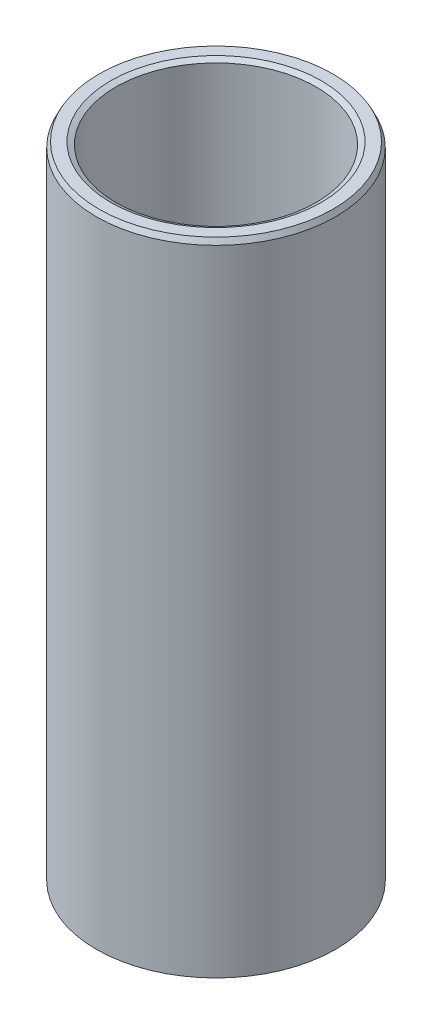
ISO-10303-21;
HEADER;
FILE_DESCRIPTION(('STEP AP214'),'2;1');
FILE_NAME('part.step','',(''),(''),'','','');
FILE_SCHEMA(('AUTOMOTIVE_DESIGN { 1 0 10303 214 1 1 1 1 }'));
ENDSEC;
DATA;
#1=APPLICATION_CONTEXT('core data for automotive mechanical design processes');
#2=APPLICATION_PROTOCOL_DEFINITION('international standard','automotive_design',2000,#1);
#3=PRODUCT_CONTEXT('',#1,'mechanical');
#4=PRODUCT('Part','Part','',(#3));
#5=PRODUCT_RELATED_PRODUCT_CATEGORY('part','',(#4));
#6=PRODUCT_DEFINITION_FORMATION('','',#4);
#7=PRODUCT_DEFINITION_CONTEXT('part definition',#1,'design');
#8=PRODUCT_DEFINITION('design','',#6,#7);
#9=PRODUCT_DEFINITION_SHAPE('','',#8);
#10=(LENGTH_UNIT() NAMED_UNIT(*) SI_UNIT(.MILLI.,.METRE.));
#11=(NAMED_UNIT(*) PLANE_ANGLE_UNIT() SI_UNIT($,.RADIAN.));
#12=(NAMED_UNIT(*) SI_UNIT($,.STERADIAN.) SOLID_ANGLE_UNIT());
#13=UNCERTAINTY_MEASURE_WITH_UNIT(LENGTH_MEASURE(1.E-05),#10,'distance_accuracy_value','');
#14=(GEOMETRIC_REPRESENTATION_CONTEXT(3) GLOBAL_UNCERTAINTY_ASSIGNED_CONTEXT((#13)) GLOBAL_UNIT_ASSIGNED_CONTEXT((#10,
#11,#12)) REPRESENTATION_CONTEXT('',''));
#15=CARTESIAN_POINT('',(0.,0.,0.));
#16=DIRECTION('',(0.,0.,1.));
#17=DIRECTION('',(1.,0.,0.));
#18=AXIS2_PLACEMENT_3D('',#15,#16,#17);
#19=CARTESIAN_POINT('',(0.,295.097850444931,0.));
#20=DIRECTION('',(0.,-1.,0.));
#21=DIRECTION('',(0.,0.,-1.));
#22=AXIS2_PLACEMENT_3D('',#19,#20,#21);
#23=CYLINDRICAL_SURFACE('',#22,55.);
#24=CARTESIAN_POINT('',(0.,1.23175515524115,0.));
#25=DIRECTION('',(0.,1.,0.));
#26=DIRECTION('',(0.,0.,1.));
#27=AXIS2_PLACEMENT_3D('',#24,#25,#26);
#28=CIRCLE('',#27,55.);
#29=CARTESIAN_POINT('',(0.,1.23175515524115,55.));
#30=VERTEX_POINT('',#29);
#31=EDGE_CURVE('E10',#30,#30,#28,.T.);
#32=ORIENTED_EDGE('',*,*,#31,.T.);
#33=EDGE_LOOP('',(#32));
#34=FACE_BOUND('',#33,.T.);
#35=CARTESIAN_POINT('',(0.,292.690359162559,0.));
#36=DIRECTION('',(0.,1.,0.));
#37=DIRECTION('',(0.,0.,1.));
#38=AXIS2_PLACEMENT_3D('',#35,#36,#37);
#39=CIRCLE('',#38,55.);
#40=CARTESIAN_POINT('',(0.,292.690359162559,55.));
#41=VERTEX_POINT('',#40);
#42=EDGE_CURVE('E50',#41,#41,#39,.F.);
#43=ORIENTED_EDGE('',*,*,#42,.T.);
#44=EDGE_LOOP('',(#43));
#45=FACE_BOUND('',#44,.T.);
#46=ADVANCED_FACE('F39',(#34,#45),#23,.T.);
#47=CARTESIAN_POINT('',(0.,295.097850444931,0.));
#48=DIRECTION('',(0.,1.,0.));
#49=DIRECTION('',(0.,0.,1.));
#50=AXIS2_PLACEMENT_3D('',#47,#48,#49);
#51=PLANE('',#50);
#52=CARTESIAN_POINT('',(0.,295.097850444931,0.));
#53=DIRECTION('',(0.,1.,0.));
#54=DIRECTION('',(0.,0.,1.));
#55=AXIS2_PLACEMENT_3D('',#52,#53,#54);
#56=CIRCLE('',#55,48.4116366517772);
#57=CARTESIAN_POINT('',(0.,295.097850444931,48.4116366517772));
#58=VERTEX_POINT('',#57);
#59=EDGE_CURVE('E58',#58,#58,#56,.F.);
#60=ORIENTED_EDGE('',*,*,#59,.T.);
#61=EDGE_LOOP('',(#60));
#62=FACE_BOUND('',#61,.T.);
#63=CARTESIAN_POINT('',(0.,295.097850444931,0.));
#64=DIRECTION('',(0.,1.,0.));
#65=DIRECTION('',(0.,0.,1.));
#66=AXIS2_PLACEMENT_3D('',#63,#64,#65);
#67=CIRCLE('',#66,53.7682448447589);
#68=CARTESIAN_POINT('',(0.,295.097850444931,53.7682448447589));
#69=VERTEX_POINT('',#68);
#70=EDGE_CURVE('E61',#69,#69,#67,.T.);
#71=ORIENTED_EDGE('',*,*,#70,.T.);
#72=EDGE_LOOP('',(#71));
#73=FACE_BOUND('',#72,.T.);
#74=ADVANCED_FACE('F88',(#62,#73),#51,.T.);
#75=CARTESIAN_POINT('',(0.,0.,0.));
#76=DIRECTION('',(0.,1.,0.));
#77=DIRECTION('',(0.,0.,1.));
#78=AXIS2_PLACEMENT_3D('',#75,#76,#77);
#79=PLANE('',#78);
#80=CARTESIAN_POINT('',(0.,0.,0.));
#81=DIRECTION('',(0.,1.,0.));
#82=DIRECTION('',(0.,0.,1.));
#83=AXIS2_PLACEMENT_3D('',#80,#81,#82);
#84=CIRCLE('',#83,47.2359005246458);
#85=CARTESIAN_POINT('',(0.,0.,47.2359005246458));
#86=VERTEX_POINT('',#85);
#87=EDGE_CURVE('E51',#86,#86,#84,.T.);
#88=ORIENTED_EDGE('',*,*,#87,.T.);
#89=EDGE_LOOP('',(#88));
#90=FACE_BOUND('',#89,.T.);
#91=CARTESIAN_POINT('',(0.,0.,0.));
#92=DIRECTION('',(0.,1.,0.));
#93=DIRECTION('',(0.,0.,1.));
#94=AXIS2_PLACEMENT_3D('',#91,#92,#93);
#95=CIRCLE('',#94,52.5925087176276);
#96=CARTESIAN_POINT('',(0.,0.,52.5925087176276));
#97=VERTEX_POINT('',#96);
#98=EDGE_CURVE('E54',#97,#97,#95,.F.);
#99=ORIENTED_EDGE('',*,*,#98,.T.);
#100=EDGE_LOOP('',(#99));
#101=FACE_BOUND('',#100,.T.);
#102=ADVANCED_FACE('F83',(#90,#101),#79,.F.);
#103=CARTESIAN_POINT('',(0.,295.097850444931,0.));
#104=DIRECTION('',(0.,-1.,0.));
#105=DIRECTION('',(0.,0.,-1.));
#106=AXIS2_PLACEMENT_3D('',#103,#104,#105);
#107=CYLINDRICAL_SURFACE('',#106,46.0041453694047);
#108=CARTESIAN_POINT('',(0.,293.86609528969,0.));
#109=DIRECTION('',(0.,1.,0.));
#110=DIRECTION('',(0.,0.,1.));
#111=AXIS2_PLACEMENT_3D('',#108,#109,#110);
#112=CIRCLE('',#111,46.0041453694047);
#113=CARTESIAN_POINT('',(0.,293.86609528969,46.0041453694047));
#114=VERTEX_POINT('',#113);
#115=EDGE_CURVE('E67',#114,#114,#112,.T.);
#116=ORIENTED_EDGE('',*,*,#115,.T.);
#117=EDGE_LOOP('',(#116));
#118=FACE_BOUND('',#117,.T.);
#119=CARTESIAN_POINT('',(0.,2.40749128237233,0.));
#120=DIRECTION('',(0.,1.,0.));
#121=DIRECTION('',(0.,0.,1.));
#122=AXIS2_PLACEMENT_3D('',#119,#120,#121);
#123=CIRCLE('',#122,46.0041453694047);
#124=CARTESIAN_POINT('',(0.,2.40749128237233,46.0041453694047));
#125=VERTEX_POINT('',#124);
#126=EDGE_CURVE('E69',#125,#125,#123,.F.);
#127=ORIENTED_EDGE('',*,*,#126,.T.);
#128=EDGE_LOOP('',(#127));
#129=FACE_BOUND('',#128,.T.);
#130=ADVANCED_FACE('F71',(#118,#129),#107,.F.);
#131=CARTESIAN_POINT('',(0.,293.86609528969,0.));
#132=DIRECTION('',(0.,1.,0.));
#133=DIRECTION('',(0.,0.,1.));
#134=AXIS2_PLACEMENT_3D('',#131,#132,#133);
#135=CONICAL_SURFACE('',#134,46.0041453694047,1.09788464382234);
#136=ORIENTED_EDGE('',*,*,#59,.F.);
#137=EDGE_LOOP('',(#136));
#138=FACE_BOUND('',#137,.T.);
#139=ORIENTED_EDGE('',*,*,#115,.F.);
#140=EDGE_LOOP('',(#139));
#141=FACE_BOUND('',#140,.T.);
#142=ADVANCED_FACE('F77',(#138,#141),#135,.F.);
#143=CARTESIAN_POINT('',(0.,0.,0.));
#144=DIRECTION('',(0.,-1.,0.));
#145=DIRECTION('',(0.,0.,-1.));
#146=AXIS2_PLACEMENT_3D('',#143,#144,#145);
#147=CONICAL_SURFACE('',#146,47.2359005246458,0.472911682972565);
#148=ORIENTED_EDGE('',*,*,#126,.F.);
#149=EDGE_LOOP('',(#148));
#150=FACE_BOUND('',#149,.T.);
#151=ORIENTED_EDGE('',*,*,#87,.F.);
#152=EDGE_LOOP('',(#151));
#153=FACE_BOUND('',#152,.T.);
#154=ADVANCED_FACE('F73',(#150,#153),#147,.F.);
#155=CARTESIAN_POINT('',(0.,1.23175515524115,0.));
#156=DIRECTION('',(0.,1.,0.));
#157=DIRECTION('',(0.,0.,1.));
#158=AXIS2_PLACEMENT_3D('',#155,#156,#157);
#159=CONICAL_SURFACE('',#158,55.,1.09788464382232);
#160=ORIENTED_EDGE('',*,*,#98,.F.);
#161=EDGE_LOOP('',(#160));
#162=FACE_BOUND('',#161,.T.);
#163=ORIENTED_EDGE('',*,*,#31,.F.);
#164=EDGE_LOOP('',(#163));
#165=FACE_BOUND('',#164,.T.);
#166=ADVANCED_FACE('F76',(#162,#165),#159,.T.);
#167=CARTESIAN_POINT('',(0.,295.097850444931,0.));
#168=DIRECTION('',(0.,-1.,0.));
#169=DIRECTION('',(0.,0.,-1.));
#170=AXIS2_PLACEMENT_3D('',#167,#168,#169);
#171=CONICAL_SURFACE('',#170,53.7682448447589,0.472911682972558);
#172=ORIENTED_EDGE('',*,*,#42,.F.);
#173=EDGE_LOOP('',(#172));
#174=FACE_BOUND('',#173,.T.);
#175=ORIENTED_EDGE('',*,*,#70,.F.);
#176=EDGE_LOOP('',(#175));
#177=FACE_BOUND('',#176,.T.);
#178=ADVANCED_FACE('F45',(#174,#177),#171,.T.);
#179=CLOSED_SHELL('',(#46,#74,#102,#130,#142,#154,#166,#178));
#180=MANIFOLD_SOLID_BREP('B2',#179);
#181=ADVANCED_BREP_SHAPE_REPRESENTATION('',(#18,#180),#14);
#182=SHAPE_DEFINITION_REPRESENTATION(#9,#181);
ENDSEC;
END-ISO-10303-21;
